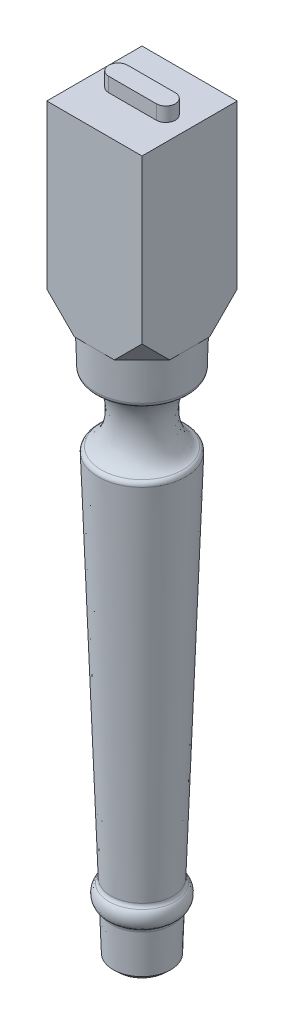
ISO-10303-21;
HEADER;
FILE_DESCRIPTION(('STEP AP214'),'2;1');
FILE_NAME('part.step','',(''),(''),'','','');
FILE_SCHEMA(('AUTOMOTIVE_DESIGN { 1 0 10303 214 1 1 1 1 }'));
ENDSEC;
DATA;
#1=APPLICATION_CONTEXT('core data for automotive mechanical design processes');
#2=APPLICATION_PROTOCOL_DEFINITION('international standard','automotive_design',2000,#1);
#3=PRODUCT_CONTEXT('',#1,'mechanical');
#4=PRODUCT('Part','Part','',(#3));
#5=PRODUCT_RELATED_PRODUCT_CATEGORY('part','',(#4));
#6=PRODUCT_DEFINITION_FORMATION('','',#4);
#7=PRODUCT_DEFINITION_CONTEXT('part definition',#1,'design');
#8=PRODUCT_DEFINITION('design','',#6,#7);
#9=PRODUCT_DEFINITION_SHAPE('','',#8);
#10=(LENGTH_UNIT() NAMED_UNIT(*) SI_UNIT(.MILLI.,.METRE.));
#11=(NAMED_UNIT(*) PLANE_ANGLE_UNIT() SI_UNIT($,.RADIAN.));
#12=(NAMED_UNIT(*) SI_UNIT($,.STERADIAN.) SOLID_ANGLE_UNIT());
#13=UNCERTAINTY_MEASURE_WITH_UNIT(LENGTH_MEASURE(1.E-05),#10,'distance_accuracy_value','');
#14=(GEOMETRIC_REPRESENTATION_CONTEXT(3) GLOBAL_UNCERTAINTY_ASSIGNED_CONTEXT((#13)) GLOBAL_UNIT_ASSIGNED_CONTEXT((#10,
#11,#12)) REPRESENTATION_CONTEXT('',''));
#15=CARTESIAN_POINT('',(0.,0.,0.));
#16=DIRECTION('',(0.,0.,1.));
#17=DIRECTION('',(1.,0.,0.));
#18=AXIS2_PLACEMENT_3D('',#15,#16,#17);
#19=CARTESIAN_POINT('',(50.,780.,-50.));
#20=DIRECTION('',(1.,0.,0.));
#21=DIRECTION('',(0.,0.,-1.));
#22=AXIS2_PLACEMENT_3D('',#19,#20,#21);
#23=PLANE('',#22);
#24=DIRECTION('',(0.,-1.,0.));
#25=VECTOR('',#24,1.);
#26=CARTESIAN_POINT('',(50.,780.,50.));
#27=LINE('',#26,#25);
#28=CARTESIAN_POINT('',(50.,780.,50.));
#29=VERTEX_POINT('',#28);
#30=CARTESIAN_POINT('',(50.,609.,50.));
#31=VERTEX_POINT('',#30);
#32=EDGE_CURVE('E350',#29,#31,#27,.T.);
#33=ORIENTED_EDGE('',*,*,#32,.T.);
#34=DIRECTION('',(0.,-0.707106781186548,-0.707106781186547));
#35=VECTOR('',#34,1.);
#36=CARTESIAN_POINT('',(50.,644.5,85.5));
#37=LINE('',#36,#35);
#38=CARTESIAN_POINT('',(50.,580.,20.9999999999998));
#39=VERTEX_POINT('',#38);
#40=EDGE_CURVE('E60',#31,#39,#37,.T.);
#41=ORIENTED_EDGE('',*,*,#40,.T.);
#42=DIRECTION('',(0.,0.,1.));
#43=VECTOR('',#42,1.);
#44=CARTESIAN_POINT('',(50.,580.,-50.));
#45=LINE('',#44,#43);
#46=CARTESIAN_POINT('',(50.,580.,0.));
#47=VERTEX_POINT('',#46);
#48=EDGE_CURVE('E158',#47,#39,#45,.T.);
#49=ORIENTED_EDGE('',*,*,#48,.F.);
#50=CARTESIAN_POINT('',(50.,580.,-21.0000000000002));
#51=VERTEX_POINT('',#50);
#52=EDGE_CURVE('E341',#51,#47,#45,.T.);
#53=ORIENTED_EDGE('',*,*,#52,.F.);
#54=DIRECTION('',(0.,0.707106781186548,-0.707106781186547));
#55=VECTOR('',#54,1.);
#56=CARTESIAN_POINT('',(50.,694.5,-135.5));
#57=LINE('',#56,#55);
#58=CARTESIAN_POINT('',(50.,609.,-50.));
#59=VERTEX_POINT('',#58);
#60=EDGE_CURVE('E163',#51,#59,#57,.T.);
#61=ORIENTED_EDGE('',*,*,#60,.T.);
#62=DIRECTION('',(0.,-1.,0.));
#63=VECTOR('',#62,1.);
#64=CARTESIAN_POINT('',(50.,780.,-50.));
#65=LINE('',#64,#63);
#66=CARTESIAN_POINT('',(50.,780.,-50.));
#67=VERTEX_POINT('',#66);
#68=EDGE_CURVE('E346',#67,#59,#65,.T.);
#69=ORIENTED_EDGE('',*,*,#68,.F.);
#70=DIRECTION('',(0.,0.,1.));
#71=VECTOR('',#70,1.);
#72=CARTESIAN_POINT('',(50.,780.,-50.));
#73=LINE('',#72,#71);
#74=EDGE_CURVE('E374',#67,#29,#73,.T.);
#75=ORIENTED_EDGE('',*,*,#74,.T.);
#76=EDGE_LOOP('',(#33,#41,#49,#53,#61,#69,#75));
#77=FACE_BOUND('',#76,.T.);
#78=ADVANCED_FACE('F43',(#77),#23,.T.);
#79=CARTESIAN_POINT('',(-50.,780.,-50.));
#80=DIRECTION('',(0.,0.,-1.));
#81=DIRECTION('',(-1.,0.,0.));
#82=AXIS2_PLACEMENT_3D('',#79,#80,#81);
#83=PLANE('',#82);
#84=ORIENTED_EDGE('',*,*,#68,.T.);
#85=DIRECTION('',(-0.707106781186547,-0.707106781186548,0.));
#86=VECTOR('',#85,1.);
#87=CARTESIAN_POINT('',(85.5000000000002,644.5,-50.));
#88=LINE('',#87,#86);
#89=CARTESIAN_POINT('',(21.0000000000002,580.,-50.));
#90=VERTEX_POINT('',#89);
#91=EDGE_CURVE('E172',#59,#90,#88,.T.);
#92=ORIENTED_EDGE('',*,*,#91,.T.);
#93=DIRECTION('',(1.,0.,0.));
#94=VECTOR('',#93,1.);
#95=CARTESIAN_POINT('',(-50.,580.,-50.));
#96=LINE('',#95,#94);
#97=CARTESIAN_POINT('',(0.,580.,-50.));
#98=VERTEX_POINT('',#97);
#99=EDGE_CURVE('E331',#98,#90,#96,.T.);
#100=ORIENTED_EDGE('',*,*,#99,.F.);
#101=CARTESIAN_POINT('',(-20.9999999999999,580.,-50.));
#102=VERTEX_POINT('',#101);
#103=EDGE_CURVE('E327',#102,#98,#96,.T.);
#104=ORIENTED_EDGE('',*,*,#103,.F.);
#105=DIRECTION('',(-0.707106781186547,0.707106781186548,0.));
#106=VECTOR('',#105,1.);
#107=CARTESIAN_POINT('',(-135.5,694.5,-50.));
#108=LINE('',#107,#106);
#109=CARTESIAN_POINT('',(-50.,609.,-50.));
#110=VERTEX_POINT('',#109);
#111=EDGE_CURVE('E180',#102,#110,#108,.T.);
#112=ORIENTED_EDGE('',*,*,#111,.T.);
#113=DIRECTION('',(0.,-1.,0.));
#114=VECTOR('',#113,1.);
#115=CARTESIAN_POINT('',(-50.,780.,-50.));
#116=LINE('',#115,#114);
#117=CARTESIAN_POINT('',(-50.,780.,-50.));
#118=VERTEX_POINT('',#117);
#119=EDGE_CURVE('E321',#118,#110,#116,.T.);
#120=ORIENTED_EDGE('',*,*,#119,.F.);
#121=DIRECTION('',(1.,0.,0.));
#122=VECTOR('',#121,1.);
#123=CARTESIAN_POINT('',(-50.,780.,-50.));
#124=LINE('',#123,#122);
#125=EDGE_CURVE('E347',#118,#67,#124,.T.);
#126=ORIENTED_EDGE('',*,*,#125,.T.);
#127=EDGE_LOOP('',(#84,#92,#100,#104,#112,#120,#126));
#128=FACE_BOUND('',#127,.T.);
#129=ADVANCED_FACE('F272',(#128),#83,.T.);
#130=CARTESIAN_POINT('',(0.,0.,0.));
#131=DIRECTION('',(0.,-1.,0.));
#132=DIRECTION('',(0.,0.,-1.));
#133=AXIS2_PLACEMENT_3D('',#130,#131,#132);
#134=PLANE('',#133);
#135=CARTESIAN_POINT('',(0.,0.,0.));
#136=DIRECTION('',(0.,-1.,0.));
#137=DIRECTION('',(0.,0.,-1.));
#138=AXIS2_PLACEMENT_3D('',#135,#136,#137);
#139=CIRCLE('',#138,24.8183506683762);
#140=CARTESIAN_POINT('',(0.,0.,-24.8183506683762));
#141=VERTEX_POINT('',#140);
#142=EDGE_CURVE('E203',#141,#141,#139,.T.);
#143=ORIENTED_EDGE('',*,*,#142,.T.);
#144=EDGE_LOOP('',(#143));
#145=FACE_BOUND('',#144,.T.);
#146=ADVANCED_FACE('F268',(#145),#134,.T.);
#147=CARTESIAN_POINT('',(0.,0.,0.));
#148=DIRECTION('',(0.,1.,0.));
#149=DIRECTION('',(0.,0.,1.));
#150=AXIS2_PLACEMENT_3D('',#147,#148,#149);
#151=CONICAL_SURFACE('',#150,30.,0.0344691009995081);
#152=CARTESIAN_POINT('',(0.,4.99702999676799,0.));
#153=DIRECTION('',(0.,-1.,0.));
#154=DIRECTION('',(0.,0.,-1.));
#155=AXIS2_PLACEMENT_3D('',#152,#153,#154);
#156=CIRCLE('',#155,30.1723113791989);
#157=CARTESIAN_POINT('',(0.,4.99702999676799,-30.1723113791989));
#158=VERTEX_POINT('',#157);
#159=EDGE_CURVE('E199',#158,#158,#156,.F.);
#160=ORIENTED_EDGE('',*,*,#159,.T.);
#161=EDGE_LOOP('',(#160));
#162=FACE_BOUND('',#161,.T.);
#163=CARTESIAN_POINT('',(0.,46.4168806316465,0.));
#164=DIRECTION('',(0.,1.,0.));
#165=DIRECTION('',(0.,0.,1.));
#166=AXIS2_PLACEMENT_3D('',#163,#164,#165);
#167=CIRCLE('',#166,31.6005820907464);
#168=CARTESIAN_POINT('',(0.,46.4168806316465,31.6005820907464));
#169=VERTEX_POINT('',#168);
#170=EDGE_CURVE('E207',#169,#169,#167,.F.);
#171=ORIENTED_EDGE('',*,*,#170,.T.);
#172=EDGE_LOOP('',(#171));
#173=FACE_BOUND('',#172,.T.);
#174=ADVANCED_FACE('F264',(#162,#173),#151,.T.);
#175=CARTESIAN_POINT('',(32.0689655172414,60.,0.));
#176=DIRECTION('',(0.,0.,1.));
#177=DIRECTION('',(0.,-1.,0.));
#178=AXIS2_PLACEMENT_3D('',#175,#176,#177);
#179=ELLIPSE('',#178,10.,6.07142857142854);
#180=CARTESIAN_POINT('',(0.,0.,0.));
#181=DIRECTION('',(0.,-1.,0.));
#182=AXIS1_PLACEMENT('',#180,#181);
#183=SURFACE_OF_REVOLUTION('',#179,#182);
#184=CARTESIAN_POINT('',(0.,69.1240143567164,0.));
#185=DIRECTION('',(0.,-1.,0.));
#186=DIRECTION('',(0.,0.,-1.));
#187=AXIS2_PLACEMENT_3D('',#184,#185,#186);
#188=CIRCLE('',#187,34.5539799464605);
#189=CARTESIAN_POINT('',(0.,69.1240143567164,-34.5539799464605));
#190=VERTEX_POINT('',#189);
#191=EDGE_CURVE('E211',#190,#190,#188,.T.);
#192=ORIENTED_EDGE('',*,*,#191,.T.);
#193=EDGE_LOOP('',(#192));
#194=FACE_BOUND('',#193,.T.);
#195=CARTESIAN_POINT('',(0.,50.5687081114827,0.));
#196=DIRECTION('',(0.,-1.,0.));
#197=DIRECTION('',(0.,0.,-1.));
#198=AXIS2_PLACEMENT_3D('',#195,#196,#197);
#199=CIRCLE('',#198,34.0872688584354);
#200=CARTESIAN_POINT('',(0.,50.5687081114827,-34.0872688584354));
#201=VERTEX_POINT('',#200);
#202=EDGE_CURVE('E215',#201,#201,#199,.F.);
#203=ORIENTED_EDGE('',*,*,#202,.T.);
#204=EDGE_LOOP('',(#203));
#205=FACE_BOUND('',#204,.T.);
#206=ADVANCED_FACE('F260',(#194,#205),#183,.F.);
#207=CARTESIAN_POINT('',(0.,69.9839104793648,0.));
#208=DIRECTION('',(0.,1.,0.));
#209=DIRECTION('',(0.,0.,1.));
#210=AXIS2_PLACEMENT_3D('',#207,#208,#209);
#211=CONICAL_SURFACE('',#210,32.4132382923919,0.034469100999508);
#212=CARTESIAN_POINT('',(0.,461.075600756757,0.));
#213=DIRECTION('',(0.,-1.,0.));
#214=DIRECTION('',(0.,0.,-1.));
#215=AXIS2_PLACEMENT_3D('',#212,#213,#214);
#216=CIRCLE('',#215,45.8991586467847);
#217=CARTESIAN_POINT('',(0.,461.075600756757,-45.8991586467847));
#218=VERTEX_POINT('',#217);
#219=EDGE_CURVE('E219',#218,#218,#216,.T.);
#220=ORIENTED_EDGE('',*,*,#219,.T.);
#221=EDGE_LOOP('',(#220));
#222=FACE_BOUND('',#221,.T.);
#223=CARTESIAN_POINT('',(0.,73.3177294213322,0.));
#224=DIRECTION('',(0.,1.,0.));
#225=DIRECTION('',(0.,0.,1.));
#226=AXIS2_PLACEMENT_3D('',#223,#224,#225);
#227=CIRCLE('',#226,32.5281975662528);
#228=CARTESIAN_POINT('',(0.,73.3177294213322,32.5281975662528));
#229=VERTEX_POINT('',#228);
#230=EDGE_CURVE('E223',#229,#229,#227,.T.);
#231=ORIENTED_EDGE('',*,*,#230,.T.);
#232=EDGE_LOOP('',(#231));
#233=FACE_BOUND('',#232,.T.);
#234=ADVANCED_FACE('F255',(#222,#233),#211,.T.);
#235=CARTESIAN_POINT('',(47.2413793103448,500.,0.));
#236=DIRECTION('',(0.,0.,-1.));
#237=DIRECTION('',(0.,-1.,0.));
#238=AXIS2_PLACEMENT_3D('',#235,#236,#237);
#239=ELLIPSE('',#238,35.,20.);
#240=CARTESIAN_POINT('',(0.,0.,0.));
#241=DIRECTION('',(0.,-1.,0.));
#242=AXIS1_PLACEMENT('',#240,#241);
#243=SURFACE_OF_REVOLUTION('',#239,#242);
#244=CARTESIAN_POINT('',(0.,534.715894791089,0.));
#245=DIRECTION('',(0.,-1.,0.));
#246=DIRECTION('',(0.,0.,-1.));
#247=AXIS2_PLACEMENT_3D('',#244,#245,#246);
#248=CIRCLE('',#247,44.6982558023683);
#249=CARTESIAN_POINT('',(0.,534.715894791089,-44.6982558023683));
#250=VERTEX_POINT('',#249);
#251=EDGE_CURVE('E231',#250,#250,#248,.T.);
#252=ORIENTED_EDGE('',*,*,#251,.T.);
#253=EDGE_LOOP('',(#252));
#254=FACE_BOUND('',#253,.T.);
#255=CARTESIAN_POINT('',(0.,465.887459636365,0.));
#256=DIRECTION('',(0.,-1.,0.));
#257=DIRECTION('',(0.,0.,-1.));
#258=AXIS2_PLACEMENT_3D('',#255,#256,#257);
#259=CIRCLE('',#258,42.766156276273);
#260=CARTESIAN_POINT('',(0.,465.887459636365,-42.766156276273));
#261=VERTEX_POINT('',#260);
#262=EDGE_CURVE('E235',#261,#261,#259,.F.);
#263=ORIENTED_EDGE('',*,*,#262,.T.);
#264=EDGE_LOOP('',(#263));
#265=FACE_BOUND('',#264,.T.);
#266=ADVANCED_FACE('F250',(#254,#265),#243,.F.);
#267=CARTESIAN_POINT('',(0.,534.936447298923,0.));
#268=DIRECTION('',(0.,1.,0.));
#269=DIRECTION('',(0.,0.,1.));
#270=AXIS2_PLACEMENT_3D('',#267,#268,#269);
#271=CONICAL_SURFACE('',#270,48.446084389618,0.034469100999508);
#272=CARTESIAN_POINT('',(0.,539.422316252261,0.));
#273=DIRECTION('',(0.,-1.,0.));
#274=DIRECTION('',(0.,0.,-1.));
#275=AXIS2_PLACEMENT_3D('',#272,#273,#274);
#276=CIRCLE('',#275,48.60076952594);
#277=CARTESIAN_POINT('',(0.,539.422316252261,-48.60076952594));
#278=VERTEX_POINT('',#277);
#279=EDGE_CURVE('E227',#278,#278,#276,.F.);
#280=ORIENTED_EDGE('',*,*,#279,.T.);
#281=EDGE_LOOP('',(#280));
#282=FACE_BOUND('',#281,.T.);
#283=CARTESIAN_POINT('',(0.,580.,0.));
#284=DIRECTION('',(0.,-1.,0.));
#285=DIRECTION('',(0.,0.,-1.));
#286=AXIS2_PLACEMENT_3D('',#283,#284,#285);
#287=CIRCLE('',#286,50.);
#288=EDGE_CURVE('E239',#98,#47,#287,.T.);
#289=ORIENTED_EDGE('',*,*,#288,.T.);
#290=CARTESIAN_POINT('',(0.,580.,50.));
#291=VERTEX_POINT('',#290);
#292=EDGE_CURVE('E243',#47,#291,#287,.T.);
#293=ORIENTED_EDGE('',*,*,#292,.T.);
#294=CARTESIAN_POINT('',(-50.,580.,0.));
#295=VERTEX_POINT('',#294);
#296=EDGE_CURVE('E358',#291,#295,#287,.T.);
#297=ORIENTED_EDGE('',*,*,#296,.T.);
#298=EDGE_CURVE('E244',#295,#98,#287,.T.);
#299=ORIENTED_EDGE('',*,*,#298,.T.);
#300=EDGE_LOOP('',(#289,#293,#297,#299));
#301=FACE_BOUND('',#300,.T.);
#302=ADVANCED_FACE('F254',(#282,#301),#271,.T.);
#303=CARTESIAN_POINT('',(0.,580.,0.));
#304=DIRECTION('',(0.,1.,0.));
#305=DIRECTION('',(0.,0.,1.));
#306=AXIS2_PLACEMENT_3D('',#303,#304,#305);
#307=PLANE('',#306);
#308=DIRECTION('',(-0.707106781186548,0.,-0.707106781186547));
#309=VECTOR('',#308,1.);
#310=CARTESIAN_POINT('',(35.5000000000001,580.,-35.5000000000001));
#311=LINE('',#310,#309);
#312=EDGE_CURVE('E167',#51,#90,#311,.T.);
#313=ORIENTED_EDGE('',*,*,#312,.F.);
#314=ORIENTED_EDGE('',*,*,#52,.T.);
#315=ORIENTED_EDGE('',*,*,#288,.F.);
#316=ORIENTED_EDGE('',*,*,#99,.T.);
#317=EDGE_LOOP('',(#313,#314,#315,#316));
#318=FACE_BOUND('',#317,.T.);
#319=ADVANCED_FACE('F468',(#318),#307,.F.);
#320=DIRECTION('',(0.707106781186547,0.,-0.707106781186548));
#321=VECTOR('',#320,1.);
#322=CARTESIAN_POINT('',(35.4999999999999,580.,35.4999999999999));
#323=LINE('',#322,#321);
#324=CARTESIAN_POINT('',(20.9999999999999,580.,50.));
#325=VERTEX_POINT('',#324);
#326=EDGE_CURVE('E53',#325,#39,#323,.T.);
#327=ORIENTED_EDGE('',*,*,#326,.F.);
#328=DIRECTION('',(1.,0.,0.));
#329=VECTOR('',#328,1.);
#330=CARTESIAN_POINT('',(-50.,580.,50.));
#331=LINE('',#330,#329);
#332=EDGE_CURVE('E144',#291,#325,#331,.T.);
#333=ORIENTED_EDGE('',*,*,#332,.F.);
#334=ORIENTED_EDGE('',*,*,#292,.F.);
#335=ORIENTED_EDGE('',*,*,#48,.T.);
#336=EDGE_LOOP('',(#327,#333,#334,#335));
#337=FACE_BOUND('',#336,.T.);
#338=ADVANCED_FACE('F157',(#337),#307,.F.);
#339=DIRECTION('',(0.707106781186548,0.,0.707106781186547));
#340=VECTOR('',#339,1.);
#341=CARTESIAN_POINT('',(-35.5,580.,35.5));
#342=LINE('',#341,#340);
#343=CARTESIAN_POINT('',(-50.,580.,21.));
#344=VERTEX_POINT('',#343);
#345=CARTESIAN_POINT('',(-21.,580.,50.));
#346=VERTEX_POINT('',#345);
#347=EDGE_CURVE('E195',#344,#346,#342,.T.);
#348=ORIENTED_EDGE('',*,*,#347,.F.);
#349=DIRECTION('',(0.,0.,1.));
#350=VECTOR('',#349,1.);
#351=CARTESIAN_POINT('',(-50.,580.,-50.));
#352=LINE('',#351,#350);
#353=EDGE_CURVE('E370',#295,#344,#352,.T.);
#354=ORIENTED_EDGE('',*,*,#353,.F.);
#355=ORIENTED_EDGE('',*,*,#296,.F.);
#356=EDGE_CURVE('E148',#346,#291,#331,.T.);
#357=ORIENTED_EDGE('',*,*,#356,.F.);
#358=EDGE_LOOP('',(#348,#354,#355,#357));
#359=FACE_BOUND('',#358,.T.);
#360=ADVANCED_FACE('F309',(#359),#307,.F.);
#361=CARTESIAN_POINT('',(-50.,780.,-50.));
#362=DIRECTION('',(1.,0.,0.));
#363=DIRECTION('',(0.,0.,-1.));
#364=AXIS2_PLACEMENT_3D('',#361,#362,#363);
#365=PLANE('',#364);
#366=DIRECTION('',(0.,0.707106781186548,-0.707106781186547));
#367=VECTOR('',#366,1.);
#368=CARTESIAN_POINT('',(-50.,694.5,-135.5));
#369=LINE('',#368,#367);
#370=CARTESIAN_POINT('',(-50.,580.,-20.9999999999998));
#371=VERTEX_POINT('',#370);
#372=EDGE_CURVE('E183',#371,#110,#369,.T.);
#373=ORIENTED_EDGE('',*,*,#372,.F.);
#374=EDGE_CURVE('E154',#371,#295,#352,.T.);
#375=ORIENTED_EDGE('',*,*,#374,.T.);
#376=ORIENTED_EDGE('',*,*,#353,.T.);
#377=DIRECTION('',(0.,-0.707106781186548,-0.707106781186547));
#378=VECTOR('',#377,1.);
#379=CARTESIAN_POINT('',(-50.,644.5,85.5000000000001));
#380=LINE('',#379,#378);
#381=CARTESIAN_POINT('',(-50.,609.,50.));
#382=VERTEX_POINT('',#381);
#383=EDGE_CURVE('E191',#382,#344,#380,.T.);
#384=ORIENTED_EDGE('',*,*,#383,.F.);
#385=DIRECTION('',(0.,-1.,0.));
#386=VECTOR('',#385,1.);
#387=CARTESIAN_POINT('',(-50.,780.,50.));
#388=LINE('',#387,#386);
#389=CARTESIAN_POINT('',(-50.,780.,50.));
#390=VERTEX_POINT('',#389);
#391=EDGE_CURVE('E352',#390,#382,#388,.T.);
#392=ORIENTED_EDGE('',*,*,#391,.F.);
#393=DIRECTION('',(0.,0.,1.));
#394=VECTOR('',#393,1.);
#395=CARTESIAN_POINT('',(-50.,780.,-50.));
#396=LINE('',#395,#394);
#397=EDGE_CURVE('E334',#118,#390,#396,.T.);
#398=ORIENTED_EDGE('',*,*,#397,.F.);
#399=ORIENTED_EDGE('',*,*,#119,.T.);
#400=EDGE_LOOP('',(#373,#375,#376,#384,#392,#398,#399));
#401=FACE_BOUND('',#400,.T.);
#402=ADVANCED_FACE('F307',(#401),#365,.F.);
#403=CARTESIAN_POINT('',(-50.,780.,50.));
#404=DIRECTION('',(0.,0.,-1.));
#405=DIRECTION('',(-1.,0.,0.));
#406=AXIS2_PLACEMENT_3D('',#403,#404,#405);
#407=PLANE('',#406);
#408=DIRECTION('',(-0.707106781186547,-0.707106781186548,0.));
#409=VECTOR('',#408,1.);
#410=CARTESIAN_POINT('',(85.5,644.5,50.));
#411=LINE('',#410,#409);
#412=EDGE_CURVE('E11',#31,#325,#411,.T.);
#413=ORIENTED_EDGE('',*,*,#412,.F.);
#414=ORIENTED_EDGE('',*,*,#32,.F.);
#415=DIRECTION('',(1.,0.,0.));
#416=VECTOR('',#415,1.);
#417=CARTESIAN_POINT('',(-50.,780.,50.));
#418=LINE('',#417,#416);
#419=EDGE_CURVE('E339',#390,#29,#418,.T.);
#420=ORIENTED_EDGE('',*,*,#419,.F.);
#421=ORIENTED_EDGE('',*,*,#391,.T.);
#422=DIRECTION('',(-0.707106781186547,0.707106781186548,0.));
#423=VECTOR('',#422,1.);
#424=CARTESIAN_POINT('',(-135.5,694.5,50.));
#425=LINE('',#424,#423);
#426=EDGE_CURVE('E187',#346,#382,#425,.T.);
#427=ORIENTED_EDGE('',*,*,#426,.F.);
#428=ORIENTED_EDGE('',*,*,#356,.T.);
#429=ORIENTED_EDGE('',*,*,#332,.T.);
#430=EDGE_LOOP('',(#413,#414,#420,#421,#427,#428,#429));
#431=FACE_BOUND('',#430,.T.);
#432=ADVANCED_FACE('F146',(#431),#407,.F.);
#433=CARTESIAN_POINT('',(0.,780.,0.));
#434=DIRECTION('',(0.,1.,0.));
#435=DIRECTION('',(0.,0.,1.));
#436=AXIS2_PLACEMENT_3D('',#433,#434,#435);
#437=PLANE('',#436);
#438=CARTESIAN_POINT('',(-25.,780.,0.));
#439=DIRECTION('',(0.,1.,0.));
#440=DIRECTION('',(0.,0.,1.));
#441=AXIS2_PLACEMENT_3D('',#438,#439,#440);
#442=CIRCLE('',#441,10.);
#443=CARTESIAN_POINT('',(-25.,780.,-10.));
#444=VERTEX_POINT('',#443);
#445=CARTESIAN_POINT('',(-25.,780.,10.));
#446=VERTEX_POINT('',#445);
#447=EDGE_CURVE('E410',#444,#446,#442,.T.);
#448=ORIENTED_EDGE('',*,*,#447,.F.);
#449=DIRECTION('',(-1.,0.,0.));
#450=VECTOR('',#449,1.);
#451=CARTESIAN_POINT('',(-25.,780.,-10.));
#452=LINE('',#451,#450);
#453=CARTESIAN_POINT('',(25.,780.,-10.));
#454=VERTEX_POINT('',#453);
#455=EDGE_CURVE('E397',#454,#444,#452,.T.);
#456=ORIENTED_EDGE('',*,*,#455,.F.);
#457=CARTESIAN_POINT('',(25.,780.,0.));
#458=DIRECTION('',(0.,1.,0.));
#459=DIRECTION('',(0.,0.,1.));
#460=AXIS2_PLACEMENT_3D('',#457,#458,#459);
#461=CIRCLE('',#460,10.);
#462=CARTESIAN_POINT('',(25.,780.,10.));
#463=VERTEX_POINT('',#462);
#464=EDGE_CURVE('E402',#463,#454,#461,.T.);
#465=ORIENTED_EDGE('',*,*,#464,.F.);
#466=DIRECTION('',(1.,0.,0.));
#467=VECTOR('',#466,1.);
#468=CARTESIAN_POINT('',(-25.,780.,10.));
#469=LINE('',#468,#467);
#470=EDGE_CURVE('E406',#446,#463,#469,.T.);
#471=ORIENTED_EDGE('',*,*,#470,.F.);
#472=EDGE_LOOP('',(#448,#456,#465,#471));
#473=FACE_BOUND('',#472,.T.);
#474=ORIENTED_EDGE('',*,*,#397,.T.);
#475=ORIENTED_EDGE('',*,*,#419,.T.);
#476=ORIENTED_EDGE('',*,*,#74,.F.);
#477=ORIENTED_EDGE('',*,*,#125,.F.);
#478=EDGE_LOOP('',(#474,#475,#476,#477));
#479=FACE_BOUND('',#478,.T.);
#480=ADVANCED_FACE('F306',(#473,#479),#437,.T.);
#481=DIRECTION('',(-0.707106781186547,0.,0.707106781186548));
#482=VECTOR('',#481,1.);
#483=CARTESIAN_POINT('',(-35.4999999999999,580.,-35.4999999999999));
#484=LINE('',#483,#482);
#485=EDGE_CURVE('E176',#102,#371,#484,.T.);
#486=ORIENTED_EDGE('',*,*,#485,.F.);
#487=ORIENTED_EDGE('',*,*,#103,.T.);
#488=ORIENTED_EDGE('',*,*,#298,.F.);
#489=ORIENTED_EDGE('',*,*,#374,.F.);
#490=EDGE_LOOP('',(#486,#487,#488,#489));
#491=FACE_BOUND('',#490,.T.);
#492=ADVANCED_FACE('F315',(#491),#307,.F.);
#493=CARTESIAN_POINT('',(-25.,795.,0.));
#494=DIRECTION('',(0.,-1.,0.));
#495=DIRECTION('',(0.,0.,-1.));
#496=AXIS2_PLACEMENT_3D('',#493,#494,#495);
#497=CYLINDRICAL_SURFACE('',#496,10.);
#498=ORIENTED_EDGE('',*,*,#447,.T.);
#499=DIRECTION('',(0.,-1.,0.));
#500=VECTOR('',#499,1.);
#501=CARTESIAN_POINT('',(-25.,795.,10.));
#502=LINE('',#501,#500);
#503=CARTESIAN_POINT('',(-25.,795.,10.));
#504=VERTEX_POINT('',#503);
#505=EDGE_CURVE('E380',#504,#446,#502,.T.);
#506=ORIENTED_EDGE('',*,*,#505,.F.);
#507=CARTESIAN_POINT('',(-25.,795.,0.));
#508=DIRECTION('',(0.,1.,0.));
#509=DIRECTION('',(0.,0.,1.));
#510=AXIS2_PLACEMENT_3D('',#507,#508,#509);
#511=CIRCLE('',#510,10.);
#512=CARTESIAN_POINT('',(-25.,795.,-10.));
#513=VERTEX_POINT('',#512);
#514=EDGE_CURVE('E401',#513,#504,#511,.T.);
#515=ORIENTED_EDGE('',*,*,#514,.F.);
#516=DIRECTION('',(0.,-1.,0.));
#517=VECTOR('',#516,1.);
#518=CARTESIAN_POINT('',(-25.,795.,-10.));
#519=LINE('',#518,#517);
#520=EDGE_CURVE('E392',#513,#444,#519,.T.);
#521=ORIENTED_EDGE('',*,*,#520,.T.);
#522=EDGE_LOOP('',(#498,#506,#515,#521));
#523=FACE_BOUND('',#522,.T.);
#524=ADVANCED_FACE('F431',(#523),#497,.T.);
#525=CARTESIAN_POINT('',(-25.,795.,10.));
#526=DIRECTION('',(0.,0.,-1.));
#527=DIRECTION('',(-1.,0.,0.));
#528=AXIS2_PLACEMENT_3D('',#525,#526,#527);
#529=PLANE('',#528);
#530=ORIENTED_EDGE('',*,*,#470,.T.);
#531=DIRECTION('',(0.,-1.,0.));
#532=VECTOR('',#531,1.);
#533=CARTESIAN_POINT('',(25.,795.,10.));
#534=LINE('',#533,#532);
#535=CARTESIAN_POINT('',(25.,795.,10.));
#536=VERTEX_POINT('',#535);
#537=EDGE_CURVE('E384',#536,#463,#534,.T.);
#538=ORIENTED_EDGE('',*,*,#537,.F.);
#539=DIRECTION('',(1.,0.,0.));
#540=VECTOR('',#539,1.);
#541=CARTESIAN_POINT('',(-25.,795.,10.));
#542=LINE('',#541,#540);
#543=EDGE_CURVE('E419',#504,#536,#542,.T.);
#544=ORIENTED_EDGE('',*,*,#543,.F.);
#545=ORIENTED_EDGE('',*,*,#505,.T.);
#546=EDGE_LOOP('',(#530,#538,#544,#545));
#547=FACE_BOUND('',#546,.T.);
#548=ADVANCED_FACE('F433',(#547),#529,.F.);
#549=CARTESIAN_POINT('',(25.,795.,0.));
#550=DIRECTION('',(0.,-1.,0.));
#551=DIRECTION('',(0.,0.,-1.));
#552=AXIS2_PLACEMENT_3D('',#549,#550,#551);
#553=CYLINDRICAL_SURFACE('',#552,10.);
#554=ORIENTED_EDGE('',*,*,#464,.T.);
#555=DIRECTION('',(0.,-1.,0.));
#556=VECTOR('',#555,1.);
#557=CARTESIAN_POINT('',(25.,795.,-10.));
#558=LINE('',#557,#556);
#559=CARTESIAN_POINT('',(25.,795.,-10.));
#560=VERTEX_POINT('',#559);
#561=EDGE_CURVE('E388',#560,#454,#558,.T.);
#562=ORIENTED_EDGE('',*,*,#561,.F.);
#563=CARTESIAN_POINT('',(25.,795.,0.));
#564=DIRECTION('',(0.,1.,0.));
#565=DIRECTION('',(0.,0.,1.));
#566=AXIS2_PLACEMENT_3D('',#563,#564,#565);
#567=CIRCLE('',#566,10.);
#568=EDGE_CURVE('E416',#536,#560,#567,.T.);
#569=ORIENTED_EDGE('',*,*,#568,.F.);
#570=ORIENTED_EDGE('',*,*,#537,.T.);
#571=EDGE_LOOP('',(#554,#562,#569,#570));
#572=FACE_BOUND('',#571,.T.);
#573=ADVANCED_FACE('F437',(#572),#553,.T.);
#574=CARTESIAN_POINT('',(-25.,795.,-10.));
#575=DIRECTION('',(0.,0.,1.));
#576=DIRECTION('',(1.,0.,0.));
#577=AXIS2_PLACEMENT_3D('',#574,#575,#576);
#578=PLANE('',#577);
#579=ORIENTED_EDGE('',*,*,#455,.T.);
#580=ORIENTED_EDGE('',*,*,#520,.F.);
#581=DIRECTION('',(-1.,0.,0.));
#582=VECTOR('',#581,1.);
#583=CARTESIAN_POINT('',(-25.,795.,-10.));
#584=LINE('',#583,#582);
#585=EDGE_CURVE('E396',#560,#513,#584,.T.);
#586=ORIENTED_EDGE('',*,*,#585,.F.);
#587=ORIENTED_EDGE('',*,*,#561,.T.);
#588=EDGE_LOOP('',(#579,#580,#586,#587));
#589=FACE_BOUND('',#588,.T.);
#590=ADVANCED_FACE('F439',(#589),#578,.F.);
#591=CARTESIAN_POINT('',(-25.,795.,0.));
#592=DIRECTION('',(0.,1.,0.));
#593=DIRECTION('',(0.,0.,1.));
#594=AXIS2_PLACEMENT_3D('',#591,#592,#593);
#595=PLANE('',#594);
#596=ORIENTED_EDGE('',*,*,#514,.T.);
#597=ORIENTED_EDGE('',*,*,#543,.T.);
#598=ORIENTED_EDGE('',*,*,#568,.T.);
#599=ORIENTED_EDGE('',*,*,#585,.T.);
#600=EDGE_LOOP('',(#596,#597,#598,#599));
#601=FACE_BOUND('',#600,.T.);
#602=ADVANCED_FACE('F278',(#601),#595,.T.);
#603=CARTESIAN_POINT('',(0.,539.59462763146,0.));
#604=DIRECTION('',(0.,1.,0.));
#605=DIRECTION('',(0.,0.,1.));
#606=AXIS2_PLACEMENT_3D('',#603,#604,#605);
#607=TOROIDAL_SURFACE('',#606,43.6037395291721,5.);
#608=ORIENTED_EDGE('',*,*,#279,.F.);
#609=EDGE_LOOP('',(#608));
#610=FACE_BOUND('',#609,.T.);
#611=ORIENTED_EDGE('',*,*,#251,.F.);
#612=EDGE_LOOP('',(#611));
#613=FACE_BOUND('',#612,.T.);
#614=ADVANCED_FACE('F274',(#610,#613),#607,.T.);
#615=CARTESIAN_POINT('',(0.,461.247912135955,0.));
#616=DIRECTION('',(0.,1.,0.));
#617=DIRECTION('',(0.,0.,1.));
#618=AXIS2_PLACEMENT_3D('',#615,#616,#617);
#619=TOROIDAL_SURFACE('',#618,40.9021286500168,5.);
#620=ORIENTED_EDGE('',*,*,#262,.F.);
#621=EDGE_LOOP('',(#620));
#622=FACE_BOUND('',#621,.T.);
#623=ORIENTED_EDGE('',*,*,#219,.F.);
#624=EDGE_LOOP('',(#623));
#625=FACE_BOUND('',#624,.T.);
#626=ADVANCED_FACE('F277',(#622,#625),#619,.T.);
#627=CARTESIAN_POINT('',(0.,73.1454180421333,0.));
#628=DIRECTION('',(0.,-1.,0.));
#629=DIRECTION('',(0.,0.,-1.));
#630=AXIS2_PLACEMENT_3D('',#627,#628,#629);
#631=TOROIDAL_SURFACE('',#630,37.5252275630208,5.);
#632=ORIENTED_EDGE('',*,*,#230,.F.);
#633=EDGE_LOOP('',(#632));
#634=FACE_BOUND('',#633,.T.);
#635=ORIENTED_EDGE('',*,*,#191,.F.);
#636=EDGE_LOOP('',(#635));
#637=FACE_BOUND('',#636,.T.);
#638=ADVANCED_FACE('F282',(#634,#637),#631,.F.);
#639=CARTESIAN_POINT('',(0.,46.2445692524476,0.));
#640=DIRECTION('',(0.,-1.,0.));
#641=DIRECTION('',(0.,0.,-1.));
#642=AXIS2_PLACEMENT_3D('',#639,#640,#641);
#643=TOROIDAL_SURFACE('',#642,36.5976120875144,5.);
#644=ORIENTED_EDGE('',*,*,#202,.F.);
#645=EDGE_LOOP('',(#644));
#646=FACE_BOUND('',#645,.T.);
#647=ORIENTED_EDGE('',*,*,#170,.F.);
#648=EDGE_LOOP('',(#647));
#649=FACE_BOUND('',#648,.T.);
#650=ADVANCED_FACE('F285',(#646,#649),#643,.F.);
#651=CARTESIAN_POINT('',(0.,0.,0.));
#652=DIRECTION('',(0.,1.,0.));
#653=DIRECTION('',(0.,0.,1.));
#654=AXIS2_PLACEMENT_3D('',#651,#652,#653);
#655=CONICAL_SURFACE('',#654,24.8183506683762,0.819867264396947);
#656=ORIENTED_EDGE('',*,*,#159,.F.);
#657=EDGE_LOOP('',(#656));
#658=FACE_BOUND('',#657,.T.);
#659=ORIENTED_EDGE('',*,*,#142,.F.);
#660=EDGE_LOOP('',(#659));
#661=FACE_BOUND('',#660,.T.);
#662=ADVANCED_FACE('F46',(#658,#661),#655,.T.);
#663=CARTESIAN_POINT('',(169.666666666666,169.666666666666,-169.666666666667));
#664=DIRECTION('',(-0.577350269189626,-0.577350269189625,0.577350269189626));
#665=DIRECTION('',(0.707106781186548,0.,0.707106781186547));
#666=AXIS2_PLACEMENT_3D('',#663,#664,#665);
#667=PLANE('',#666);
#668=ORIENTED_EDGE('',*,*,#383,.T.);
#669=ORIENTED_EDGE('',*,*,#347,.T.);
#670=ORIENTED_EDGE('',*,*,#426,.T.);
#671=EDGE_LOOP('',(#668,#669,#670));
#672=FACE_BOUND('',#671,.T.);
#673=ADVANCED_FACE('F292',(#672),#667,.T.);
#674=CARTESIAN_POINT('',(169.666666666667,169.666666666666,169.666666666667));
#675=DIRECTION('',(-0.577350269189626,-0.577350269189625,-0.577350269189626));
#676=DIRECTION('',(-0.707106781186547,0.,0.707106781186548));
#677=AXIS2_PLACEMENT_3D('',#674,#675,#676);
#678=PLANE('',#677);
#679=ORIENTED_EDGE('',*,*,#485,.T.);
#680=ORIENTED_EDGE('',*,*,#372,.T.);
#681=ORIENTED_EDGE('',*,*,#111,.F.);
#682=EDGE_LOOP('',(#679,#680,#681));
#683=FACE_BOUND('',#682,.T.);
#684=ADVANCED_FACE('F324',(#683),#678,.T.);
#685=CARTESIAN_POINT('',(-169.666666666666,169.666666666666,169.666666666666));
#686=DIRECTION('',(0.577350269189626,-0.577350269189625,-0.577350269189626));
#687=DIRECTION('',(-0.707106781186548,0.,-0.707106781186547));
#688=AXIS2_PLACEMENT_3D('',#685,#686,#687);
#689=PLANE('',#688);
#690=ORIENTED_EDGE('',*,*,#91,.F.);
#691=ORIENTED_EDGE('',*,*,#60,.F.);
#692=ORIENTED_EDGE('',*,*,#312,.T.);
#693=EDGE_LOOP('',(#690,#691,#692));
#694=FACE_BOUND('',#693,.T.);
#695=ADVANCED_FACE('F454',(#694),#689,.T.);
#696=CARTESIAN_POINT('',(-169.666666666667,169.666666666666,-169.666666666667));
#697=DIRECTION('',(0.577350269189626,-0.577350269189625,0.577350269189626));
#698=DIRECTION('',(0.707106781186547,0.,-0.707106781186548));
#699=AXIS2_PLACEMENT_3D('',#696,#697,#698);
#700=PLANE('',#699);
#701=ORIENTED_EDGE('',*,*,#40,.F.);
#702=ORIENTED_EDGE('',*,*,#412,.T.);
#703=ORIENTED_EDGE('',*,*,#326,.T.);
#704=EDGE_LOOP('',(#701,#702,#703));
#705=FACE_BOUND('',#704,.T.);
#706=ADVANCED_FACE('F161',(#705),#700,.T.);
#707=CLOSED_SHELL('',(#78,#129,#146,#174,#206,#234,#266,#302,#319,#338,#360,#402,#432,#480,#492,
#524,#548,#573,#590,#602,#614,#626,#638,#650,#662,#673,#684,#695,#706));
#708=MANIFOLD_SOLID_BREP('B2',#707);
#709=ADVANCED_BREP_SHAPE_REPRESENTATION('',(#18,#708),#14);
#710=SHAPE_DEFINITION_REPRESENTATION(#9,#709);
ENDSEC;
END-ISO-10303-21;
